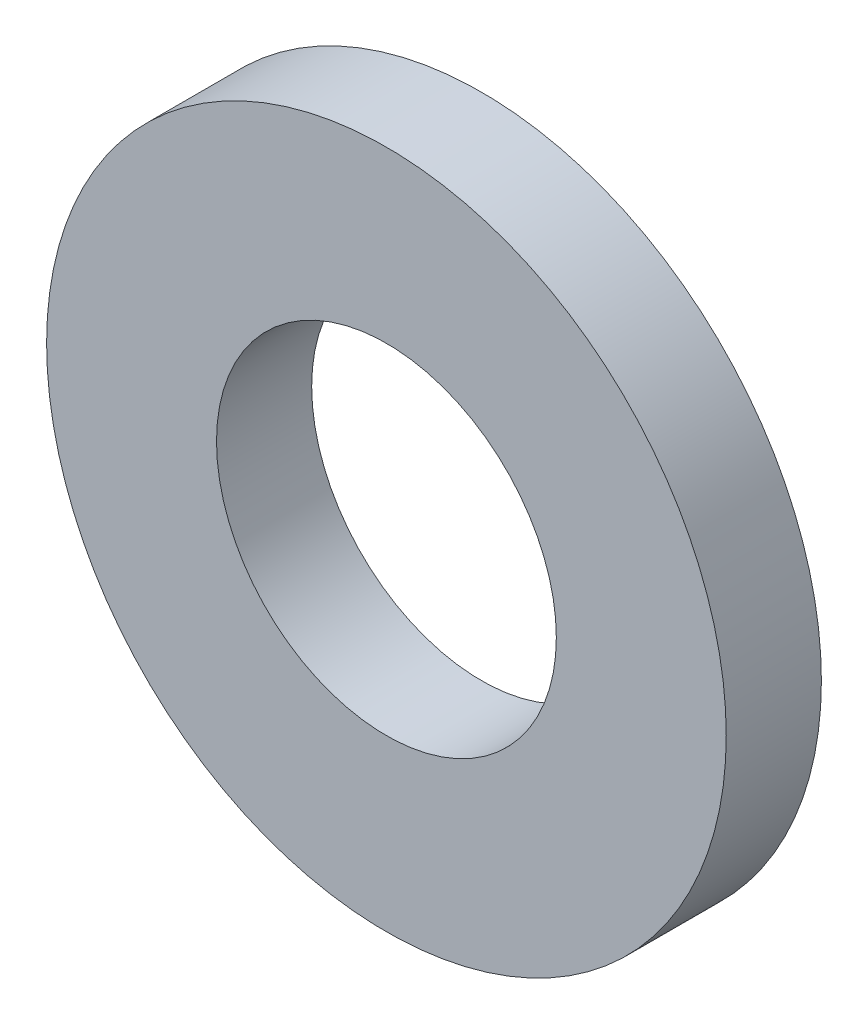
ISO-10303-21;
HEADER;
FILE_DESCRIPTION(('STEP AP214'),'2;1');
FILE_NAME('part.step','',(''),(''),'','','');
FILE_SCHEMA(('AUTOMOTIVE_DESIGN { 1 0 10303 214 1 1 1 1 }'));
ENDSEC;
DATA;
#1=APPLICATION_CONTEXT('core data for automotive mechanical design processes');
#2=APPLICATION_PROTOCOL_DEFINITION('international standard','automotive_design',2000,#1);
#3=PRODUCT_CONTEXT('',#1,'mechanical');
#4=PRODUCT('Part','Part','',(#3));
#5=PRODUCT_RELATED_PRODUCT_CATEGORY('part','',(#4));
#6=PRODUCT_DEFINITION_FORMATION('','',#4);
#7=PRODUCT_DEFINITION_CONTEXT('part definition',#1,'design');
#8=PRODUCT_DEFINITION('design','',#6,#7);
#9=PRODUCT_DEFINITION_SHAPE('','',#8);
#10=(LENGTH_UNIT() NAMED_UNIT(*) SI_UNIT(.MILLI.,.METRE.));
#11=(NAMED_UNIT(*) PLANE_ANGLE_UNIT() SI_UNIT($,.RADIAN.));
#12=(NAMED_UNIT(*) SI_UNIT($,.STERADIAN.) SOLID_ANGLE_UNIT());
#13=UNCERTAINTY_MEASURE_WITH_UNIT(LENGTH_MEASURE(1.E-05),#10,'distance_accuracy_value','');
#14=(GEOMETRIC_REPRESENTATION_CONTEXT(3) GLOBAL_UNCERTAINTY_ASSIGNED_CONTEXT((#13)) GLOBAL_UNIT_ASSIGNED_CONTEXT((#10,
#11,#12)) REPRESENTATION_CONTEXT('',''));
#15=CARTESIAN_POINT('',(0.,0.,0.));
#16=DIRECTION('',(0.,0.,1.));
#17=DIRECTION('',(1.,0.,0.));
#18=AXIS2_PLACEMENT_3D('',#15,#16,#17);
#19=CARTESIAN_POINT('',(0.,0.,2.8));
#20=DIRECTION('',(0.,0.,1.));
#21=DIRECTION('',(1.,0.,0.));
#22=AXIS2_PLACEMENT_3D('',#19,#20,#21);
#23=PLANE('',#22);
#24=CARTESIAN_POINT('',(0.,0.,2.8));
#25=DIRECTION('',(0.,0.,1.));
#26=DIRECTION('',(1.,0.,0.));
#27=AXIS2_PLACEMENT_3D('',#24,#25,#26);
#28=CIRCLE('',#27,10.);
#29=CARTESIAN_POINT('',(10.,0.,2.8));
#30=VERTEX_POINT('',#29);
#31=EDGE_CURVE('E10',#30,#30,#28,.T.);
#32=ORIENTED_EDGE('',*,*,#31,.T.);
#33=EDGE_LOOP('',(#32));
#34=FACE_BOUND('',#33,.T.);
#35=CARTESIAN_POINT('',(0.,0.,2.8));
#36=DIRECTION('',(0.,0.,1.));
#37=DIRECTION('',(1.,0.,0.));
#38=AXIS2_PLACEMENT_3D('',#35,#36,#37);
#39=CIRCLE('',#38,5.);
#40=CARTESIAN_POINT('',(5.,0.,2.8));
#41=VERTEX_POINT('',#40);
#42=EDGE_CURVE('E44',#41,#41,#39,.T.);
#43=ORIENTED_EDGE('',*,*,#42,.F.);
#44=EDGE_LOOP('',(#43));
#45=FACE_BOUND('',#44,.T.);
#46=ADVANCED_FACE('F33',(#34,#45),#23,.T.);
#47=CARTESIAN_POINT('',(0.,0.,0.));
#48=DIRECTION('',(0.,0.,1.));
#49=DIRECTION('',(1.,0.,0.));
#50=AXIS2_PLACEMENT_3D('',#47,#48,#49);
#51=PLANE('',#50);
#52=CARTESIAN_POINT('',(0.,0.,0.));
#53=DIRECTION('',(0.,0.,1.));
#54=DIRECTION('',(1.,0.,0.));
#55=AXIS2_PLACEMENT_3D('',#52,#53,#54);
#56=CIRCLE('',#55,10.);
#57=CARTESIAN_POINT('',(10.,0.,0.));
#58=VERTEX_POINT('',#57);
#59=EDGE_CURVE('E37',#58,#58,#56,.T.);
#60=ORIENTED_EDGE('',*,*,#59,.F.);
#61=EDGE_LOOP('',(#60));
#62=FACE_BOUND('',#61,.T.);
#63=CARTESIAN_POINT('',(0.,0.,0.));
#64=DIRECTION('',(0.,0.,1.));
#65=DIRECTION('',(1.,0.,0.));
#66=AXIS2_PLACEMENT_3D('',#63,#64,#65);
#67=CIRCLE('',#66,5.);
#68=CARTESIAN_POINT('',(5.,0.,0.));
#69=VERTEX_POINT('',#68);
#70=EDGE_CURVE('E46',#69,#69,#67,.T.);
#71=ORIENTED_EDGE('',*,*,#70,.T.);
#72=EDGE_LOOP('',(#71));
#73=FACE_BOUND('',#72,.T.);
#74=ADVANCED_FACE('F56',(#62,#73),#51,.F.);
#75=CARTESIAN_POINT('',(0.,0.,2.8));
#76=DIRECTION('',(0.,0.,-1.));
#77=DIRECTION('',(-1.,0.,0.));
#78=AXIS2_PLACEMENT_3D('',#75,#76,#77);
#79=CYLINDRICAL_SURFACE('',#78,10.);
#80=ORIENTED_EDGE('',*,*,#31,.F.);
#81=EDGE_LOOP('',(#80));
#82=FACE_BOUND('',#81,.T.);
#83=ORIENTED_EDGE('',*,*,#59,.T.);
#84=EDGE_LOOP('',(#83));
#85=FACE_BOUND('',#84,.T.);
#86=ADVANCED_FACE('F35',(#82,#85),#79,.T.);
#87=CARTESIAN_POINT('',(0.,0.,2.8));
#88=DIRECTION('',(0.,0.,-1.));
#89=DIRECTION('',(-1.,0.,0.));
#90=AXIS2_PLACEMENT_3D('',#87,#88,#89);
#91=CYLINDRICAL_SURFACE('',#90,5.);
#92=ORIENTED_EDGE('',*,*,#42,.T.);
#93=EDGE_LOOP('',(#92));
#94=FACE_BOUND('',#93,.T.);
#95=ORIENTED_EDGE('',*,*,#70,.F.);
#96=EDGE_LOOP('',(#95));
#97=FACE_BOUND('',#96,.T.);
#98=ADVANCED_FACE('F52',(#94,#97),#91,.F.);
#99=CLOSED_SHELL('',(#46,#74,#86,#98));
#100=MANIFOLD_SOLID_BREP('B2',#99);
#101=ADVANCED_BREP_SHAPE_REPRESENTATION('',(#18,#100),#14);
#102=SHAPE_DEFINITION_REPRESENTATION(#9,#101);
ENDSEC;
END-ISO-10303-21;
